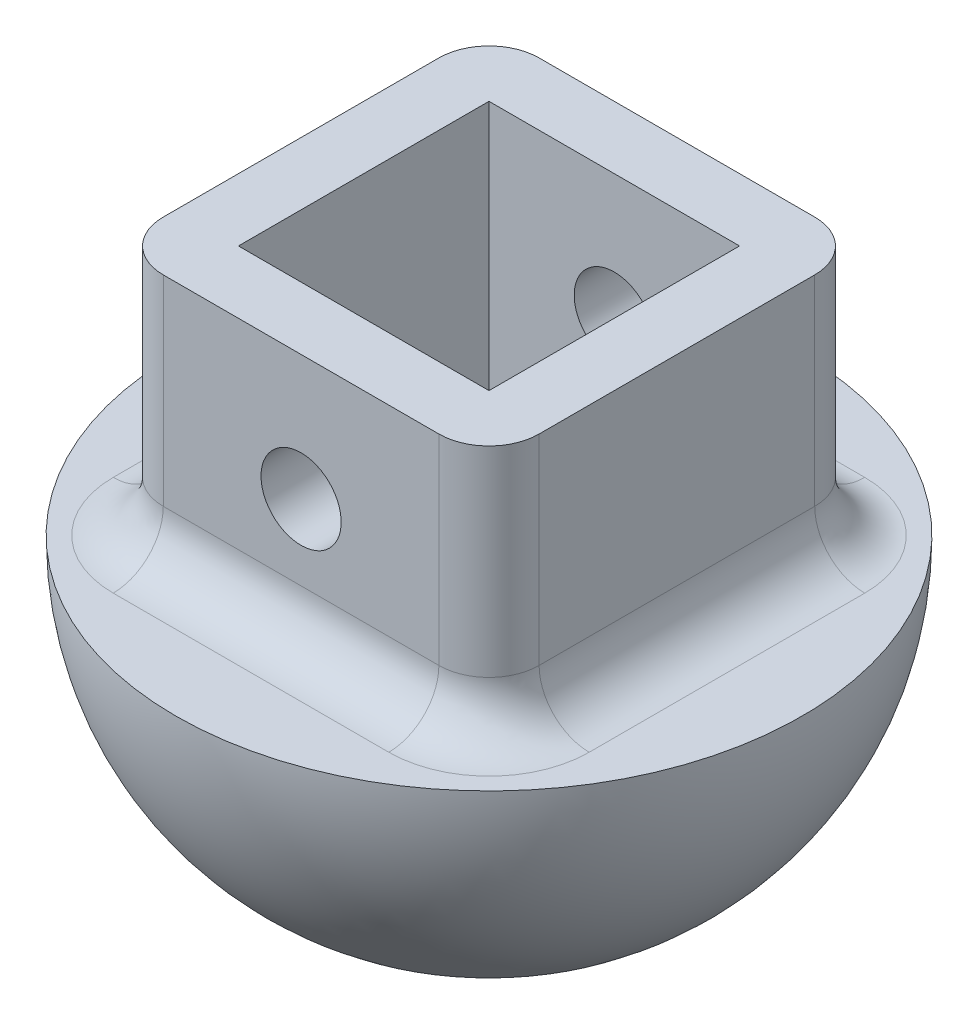
ISO-10303-21;
HEADER;
FILE_DESCRIPTION(('STEP AP214'),'2;1');
FILE_NAME('part.step','',(''),(''),'','','');
FILE_SCHEMA(('AUTOMOTIVE_DESIGN { 1 0 10303 214 1 1 1 1 }'));
ENDSEC;
DATA;
#1=APPLICATION_CONTEXT('core data for automotive mechanical design processes');
#2=APPLICATION_PROTOCOL_DEFINITION('international standard','automotive_design',2000,#1);
#3=PRODUCT_CONTEXT('',#1,'mechanical');
#4=PRODUCT('Part','Part','',(#3));
#5=PRODUCT_RELATED_PRODUCT_CATEGORY('part','',(#4));
#6=PRODUCT_DEFINITION_FORMATION('','',#4);
#7=PRODUCT_DEFINITION_CONTEXT('part definition',#1,'design');
#8=PRODUCT_DEFINITION('design','',#6,#7);
#9=PRODUCT_DEFINITION_SHAPE('','',#8);
#10=(LENGTH_UNIT() NAMED_UNIT(*) SI_UNIT(.MILLI.,.METRE.));
#11=(NAMED_UNIT(*) PLANE_ANGLE_UNIT() SI_UNIT($,.RADIAN.));
#12=(NAMED_UNIT(*) SI_UNIT($,.STERADIAN.) SOLID_ANGLE_UNIT());
#13=UNCERTAINTY_MEASURE_WITH_UNIT(LENGTH_MEASURE(1.E-05),#10,'distance_accuracy_value','');
#14=(GEOMETRIC_REPRESENTATION_CONTEXT(3) GLOBAL_UNCERTAINTY_ASSIGNED_CONTEXT((#13)) GLOBAL_UNIT_ASSIGNED_CONTEXT((#10,
#11,#12)) REPRESENTATION_CONTEXT('',''));
#15=CARTESIAN_POINT('',(0.,0.,0.));
#16=DIRECTION('',(0.,0.,1.));
#17=DIRECTION('',(1.,0.,0.));
#18=AXIS2_PLACEMENT_3D('',#15,#16,#17);
#19=CARTESIAN_POINT('',(0.,0.,0.));
#20=DIRECTION('',(0.,-1.,0.));
#21=DIRECTION('',(0.,0.,-1.));
#22=AXIS2_PLACEMENT_3D('',#19,#20,#21);
#23=PLANE('',#22);
#24=CARTESIAN_POINT('',(0.,0.,0.));
#25=DIRECTION('',(0.,-1.,0.));
#26=DIRECTION('',(0.,0.,-1.));
#27=AXIS2_PLACEMENT_3D('',#24,#25,#26);
#28=CIRCLE('',#27,12.5);
#29=CARTESIAN_POINT('',(0.,0.,-12.5));
#30=VERTEX_POINT('',#29);
#31=EDGE_CURVE('E208',#30,#30,#28,.T.);
#32=ORIENTED_EDGE('',*,*,#31,.F.);
#33=EDGE_LOOP('',(#32));
#34=FACE_BOUND('',#33,.T.);
#35=CARTESIAN_POINT('',(-5.5,0.,-5.50000000000001));
#36=DIRECTION('',(0.,-1.,0.));
#37=DIRECTION('',(0.,0.,-1.));
#38=AXIS2_PLACEMENT_3D('',#35,#36,#37);
#39=CIRCLE('',#38,4.);
#40=CARTESIAN_POINT('',(-5.5,0.,-9.50000000000001));
#41=VERTEX_POINT('',#40);
#42=CARTESIAN_POINT('',(-9.5,0.,-5.50000000000001));
#43=VERTEX_POINT('',#42);
#44=EDGE_CURVE('E240',#41,#43,#39,.F.);
#45=ORIENTED_EDGE('',*,*,#44,.F.);
#46=DIRECTION('',(-1.,0.,0.));
#47=VECTOR('',#46,1.);
#48=CARTESIAN_POINT('',(7.5,0.,-9.50000000000001));
#49=LINE('',#48,#47);
#50=CARTESIAN_POINT('',(5.5,0.,-9.50000000000001));
#51=VERTEX_POINT('',#50);
#52=EDGE_CURVE('E237',#41,#51,#49,.F.);
#53=ORIENTED_EDGE('',*,*,#52,.T.);
#54=CARTESIAN_POINT('',(5.5,0.,-5.50000000000001));
#55=DIRECTION('',(0.,-1.,0.));
#56=DIRECTION('',(0.,0.,-1.));
#57=AXIS2_PLACEMENT_3D('',#54,#55,#56);
#58=CIRCLE('',#57,4.);
#59=CARTESIAN_POINT('',(9.5,0.,-5.50000000000001));
#60=VERTEX_POINT('',#59);
#61=EDGE_CURVE('E234',#60,#51,#58,.F.);
#62=ORIENTED_EDGE('',*,*,#61,.F.);
#63=DIRECTION('',(0.,0.,-1.));
#64=VECTOR('',#63,1.);
#65=CARTESIAN_POINT('',(9.5,0.,7.5));
#66=LINE('',#65,#64);
#67=CARTESIAN_POINT('',(9.5,0.,5.49999999999999));
#68=VERTEX_POINT('',#67);
#69=EDGE_CURVE('E232',#60,#68,#66,.F.);
#70=ORIENTED_EDGE('',*,*,#69,.T.);
#71=CARTESIAN_POINT('',(5.5,0.,5.49999999999999));
#72=DIRECTION('',(0.,-1.,0.));
#73=DIRECTION('',(0.,0.,-1.));
#74=AXIS2_PLACEMENT_3D('',#71,#72,#73);
#75=CIRCLE('',#74,4.);
#76=CARTESIAN_POINT('',(5.5,0.,9.49999999999999));
#77=VERTEX_POINT('',#76);
#78=EDGE_CURVE('E229',#77,#68,#75,.F.);
#79=ORIENTED_EDGE('',*,*,#78,.F.);
#80=DIRECTION('',(1.,0.,0.));
#81=VECTOR('',#80,1.);
#82=CARTESIAN_POINT('',(-7.5,0.,9.49999999999999));
#83=LINE('',#82,#81);
#84=CARTESIAN_POINT('',(-5.5,0.,9.49999999999999));
#85=VERTEX_POINT('',#84);
#86=EDGE_CURVE('E225',#77,#85,#83,.F.);
#87=ORIENTED_EDGE('',*,*,#86,.T.);
#88=CARTESIAN_POINT('',(-5.5,0.,5.49999999999999));
#89=DIRECTION('',(0.,-1.,0.));
#90=DIRECTION('',(0.,0.,-1.));
#91=AXIS2_PLACEMENT_3D('',#88,#89,#90);
#92=CIRCLE('',#91,4.);
#93=CARTESIAN_POINT('',(-9.5,0.,5.49999999999999));
#94=VERTEX_POINT('',#93);
#95=EDGE_CURVE('E222',#94,#85,#92,.F.);
#96=ORIENTED_EDGE('',*,*,#95,.F.);
#97=DIRECTION('',(0.,0.,1.));
#98=VECTOR('',#97,1.);
#99=CARTESIAN_POINT('',(-9.5,0.,-7.5));
#100=LINE('',#99,#98);
#101=EDGE_CURVE('E227',#94,#43,#100,.F.);
#102=ORIENTED_EDGE('',*,*,#101,.T.);
#103=EDGE_LOOP('',(#45,#53,#62,#70,#79,#87,#96,#102));
#104=FACE_BOUND('',#103,.T.);
#105=ADVANCED_FACE('F39',(#34,#104),#23,.F.);
#106=CARTESIAN_POINT('',(0.,0.,0.));
#107=DIRECTION('',(-1.,0.,0.));
#108=DIRECTION('',(0.,0.,1.));
#109=AXIS2_PLACEMENT_3D('',#106,#107,#108);
#110=SPHERICAL_SURFACE('',#109,12.5);
#111=CARTESIAN_POINT('',(0.,0.,0.));
#112=DIRECTION('',(0.,-1.,0.));
#113=DIRECTION('',(0.,0.,-1.));
#114=AXIS2_PLACEMENT_3D('',#111,#112,#113);
#115=SPHERICAL_SURFACE('',#114,12.5);
#116=ORIENTED_EDGE('',*,*,#31,.T.);
#117=EDGE_LOOP('',(#116));
#118=FACE_BOUND('',#117,.T.);
#119=ADVANCED_FACE('F369',(#118),#115,.T.);
#120=CARTESIAN_POINT('',(0.,10.,0.));
#121=DIRECTION('',(0.,1.,0.));
#122=DIRECTION('',(0.,0.,1.));
#123=AXIS2_PLACEMENT_3D('',#120,#121,#122);
#124=PLANE('',#123);
#125=DIRECTION('',(0.,0.,1.));
#126=VECTOR('',#125,1.);
#127=CARTESIAN_POINT('',(-7.5,10.,-7.5));
#128=LINE('',#127,#126);
#129=CARTESIAN_POINT('',(-7.5,10.,-5.5));
#130=VERTEX_POINT('',#129);
#131=CARTESIAN_POINT('',(-7.5,10.,5.5));
#132=VERTEX_POINT('',#131);
#133=EDGE_CURVE('E202',#130,#132,#128,.T.);
#134=ORIENTED_EDGE('',*,*,#133,.T.);
#135=CARTESIAN_POINT('',(-5.5,10.,5.5));
#136=DIRECTION('',(0.,1.,0.));
#137=DIRECTION('',(0.,0.,1.));
#138=AXIS2_PLACEMENT_3D('',#135,#136,#137);
#139=CIRCLE('',#138,2.);
#140=CARTESIAN_POINT('',(-5.5,10.,7.5));
#141=VERTEX_POINT('',#140);
#142=EDGE_CURVE('E11',#132,#141,#139,.T.);
#143=ORIENTED_EDGE('',*,*,#142,.T.);
#144=DIRECTION('',(1.,0.,0.));
#145=VECTOR('',#144,1.);
#146=CARTESIAN_POINT('',(-7.5,10.,7.5));
#147=LINE('',#146,#145);
#148=CARTESIAN_POINT('',(5.5,10.,7.5));
#149=VERTEX_POINT('',#148);
#150=EDGE_CURVE('E205',#141,#149,#147,.T.);
#151=ORIENTED_EDGE('',*,*,#150,.T.);
#152=CARTESIAN_POINT('',(5.5,10.,5.5));
#153=DIRECTION('',(0.,1.,0.));
#154=DIRECTION('',(0.,0.,1.));
#155=AXIS2_PLACEMENT_3D('',#152,#153,#154);
#156=CIRCLE('',#155,2.);
#157=CARTESIAN_POINT('',(7.5,10.,5.5));
#158=VERTEX_POINT('',#157);
#159=EDGE_CURVE('E259',#149,#158,#156,.T.);
#160=ORIENTED_EDGE('',*,*,#159,.T.);
#161=DIRECTION('',(0.,0.,-1.));
#162=VECTOR('',#161,1.);
#163=CARTESIAN_POINT('',(7.5,10.,-7.5));
#164=LINE('',#163,#162);
#165=CARTESIAN_POINT('',(7.5,10.,-5.5));
#166=VERTEX_POINT('',#165);
#167=EDGE_CURVE('E171',#158,#166,#164,.T.);
#168=ORIENTED_EDGE('',*,*,#167,.T.);
#169=CARTESIAN_POINT('',(5.5,10.,-5.5));
#170=DIRECTION('',(0.,1.,0.));
#171=DIRECTION('',(0.,0.,1.));
#172=AXIS2_PLACEMENT_3D('',#169,#170,#171);
#173=CIRCLE('',#172,2.);
#174=CARTESIAN_POINT('',(5.5,10.,-7.5));
#175=VERTEX_POINT('',#174);
#176=EDGE_CURVE('E261',#166,#175,#173,.T.);
#177=ORIENTED_EDGE('',*,*,#176,.T.);
#178=DIRECTION('',(-1.,0.,0.));
#179=VECTOR('',#178,1.);
#180=CARTESIAN_POINT('',(-7.5,10.,-7.5));
#181=LINE('',#180,#179);
#182=CARTESIAN_POINT('',(-5.5,10.,-7.5));
#183=VERTEX_POINT('',#182);
#184=EDGE_CURVE('E199',#175,#183,#181,.T.);
#185=ORIENTED_EDGE('',*,*,#184,.T.);
#186=CARTESIAN_POINT('',(-5.5,10.,-5.5));
#187=DIRECTION('',(0.,1.,0.));
#188=DIRECTION('',(0.,0.,1.));
#189=AXIS2_PLACEMENT_3D('',#186,#187,#188);
#190=CIRCLE('',#189,2.);
#191=EDGE_CURVE('E48',#183,#130,#190,.T.);
#192=ORIENTED_EDGE('',*,*,#191,.T.);
#193=EDGE_LOOP('',(#134,#143,#151,#160,#168,#177,#185,#192));
#194=FACE_BOUND('',#193,.T.);
#195=DIRECTION('',(-1.,0.,0.));
#196=VECTOR('',#195,1.);
#197=CARTESIAN_POINT('',(-5.,10.,-5.));
#198=LINE('',#197,#196);
#199=CARTESIAN_POINT('',(5.,10.,-5.));
#200=VERTEX_POINT('',#199);
#201=CARTESIAN_POINT('',(-5.,10.,-5.));
#202=VERTEX_POINT('',#201);
#203=EDGE_CURVE('E163',#200,#202,#198,.T.);
#204=ORIENTED_EDGE('',*,*,#203,.F.);
#205=DIRECTION('',(0.,0.,-1.));
#206=VECTOR('',#205,1.);
#207=CARTESIAN_POINT('',(5.,10.,-5.));
#208=LINE('',#207,#206);
#209=CARTESIAN_POINT('',(5.,10.,5.));
#210=VERTEX_POINT('',#209);
#211=EDGE_CURVE('E153',#210,#200,#208,.T.);
#212=ORIENTED_EDGE('',*,*,#211,.F.);
#213=DIRECTION('',(1.,0.,0.));
#214=VECTOR('',#213,1.);
#215=CARTESIAN_POINT('',(-5.,10.,5.));
#216=LINE('',#215,#214);
#217=CARTESIAN_POINT('',(-5.,10.,5.));
#218=VERTEX_POINT('',#217);
#219=EDGE_CURVE('E179',#218,#210,#216,.T.);
#220=ORIENTED_EDGE('',*,*,#219,.F.);
#221=DIRECTION('',(0.,0.,1.));
#222=VECTOR('',#221,1.);
#223=CARTESIAN_POINT('',(-5.,10.,-5.));
#224=LINE('',#223,#222);
#225=EDGE_CURVE('E177',#202,#218,#224,.T.);
#226=ORIENTED_EDGE('',*,*,#225,.F.);
#227=EDGE_LOOP('',(#204,#212,#220,#226));
#228=FACE_BOUND('',#227,.T.);
#229=ADVANCED_FACE('F175',(#194,#228),#124,.T.);
#230=CARTESIAN_POINT('',(7.5,10.,-7.5));
#231=DIRECTION('',(-1.,0.,0.));
#232=DIRECTION('',(0.,0.,1.));
#233=AXIS2_PLACEMENT_3D('',#230,#231,#232);
#234=PLANE('',#233);
#235=DIRECTION('',(0.,0.,-1.));
#236=VECTOR('',#235,1.);
#237=CARTESIAN_POINT('',(7.5,2.00000000000005,-7.49999999999999));
#238=LINE('',#237,#236);
#239=CARTESIAN_POINT('',(7.5,1.99999999999996,5.5));
#240=VERTEX_POINT('',#239);
#241=CARTESIAN_POINT('',(7.5,2.00000000000004,-5.5));
#242=VERTEX_POINT('',#241);
#243=EDGE_CURVE('E245',#240,#242,#238,.T.);
#244=ORIENTED_EDGE('',*,*,#243,.T.);
#245=DIRECTION('',(0.,-1.,0.));
#246=VECTOR('',#245,1.);
#247=CARTESIAN_POINT('',(7.5,10.,-5.5));
#248=LINE('',#247,#246);
#249=EDGE_CURVE('E247',#242,#166,#248,.F.);
#250=ORIENTED_EDGE('',*,*,#249,.T.);
#251=ORIENTED_EDGE('',*,*,#167,.F.);
#252=DIRECTION('',(0.,-1.,0.));
#253=VECTOR('',#252,1.);
#254=CARTESIAN_POINT('',(7.5,10.,5.5));
#255=LINE('',#254,#253);
#256=EDGE_CURVE('E243',#158,#240,#255,.T.);
#257=ORIENTED_EDGE('',*,*,#256,.T.);
#258=EDGE_LOOP('',(#244,#250,#251,#257));
#259=FACE_BOUND('',#258,.T.);
#260=ADVANCED_FACE('F323',(#259),#234,.F.);
#261=CARTESIAN_POINT('',(-7.5,10.,-7.5));
#262=DIRECTION('',(0.,0.,1.));
#263=DIRECTION('',(1.,0.,0.));
#264=AXIS2_PLACEMENT_3D('',#261,#262,#263);
#265=PLANE('',#264);
#266=CARTESIAN_POINT('',(0.,5.,-7.5));
#267=DIRECTION('',(0.,0.,1.));
#268=DIRECTION('',(1.,0.,0.));
#269=AXIS2_PLACEMENT_3D('',#266,#267,#268);
#270=CIRCLE('',#269,1.6);
#271=CARTESIAN_POINT('',(1.6,5.,-7.5));
#272=VERTEX_POINT('',#271);
#273=EDGE_CURVE('E186',#272,#272,#270,.F.);
#274=ORIENTED_EDGE('',*,*,#273,.F.);
#275=EDGE_LOOP('',(#274));
#276=FACE_BOUND('',#275,.T.);
#277=DIRECTION('',(-1.,0.,0.));
#278=VECTOR('',#277,1.);
#279=CARTESIAN_POINT('',(-7.5,2.00000000000007,-7.5));
#280=LINE('',#279,#278);
#281=CARTESIAN_POINT('',(5.5,2.00000000000007,-7.5));
#282=VERTEX_POINT('',#281);
#283=CARTESIAN_POINT('',(-5.5,2.00000000000007,-7.5));
#284=VERTEX_POINT('',#283);
#285=EDGE_CURVE('E217',#282,#284,#280,.T.);
#286=ORIENTED_EDGE('',*,*,#285,.T.);
#287=DIRECTION('',(0.,-1.,0.));
#288=VECTOR('',#287,1.);
#289=CARTESIAN_POINT('',(-5.5,10.,-7.5));
#290=LINE('',#289,#288);
#291=EDGE_CURVE('E220',#284,#183,#290,.F.);
#292=ORIENTED_EDGE('',*,*,#291,.T.);
#293=ORIENTED_EDGE('',*,*,#184,.F.);
#294=DIRECTION('',(0.,-1.,0.));
#295=VECTOR('',#294,1.);
#296=CARTESIAN_POINT('',(5.5,10.,-7.5));
#297=LINE('',#296,#295);
#298=EDGE_CURVE('E211',#175,#282,#297,.T.);
#299=ORIENTED_EDGE('',*,*,#298,.T.);
#300=EDGE_LOOP('',(#286,#292,#293,#299));
#301=FACE_BOUND('',#300,.T.);
#302=ADVANCED_FACE('F354',(#276,#301),#265,.F.);
#303=CARTESIAN_POINT('',(-7.5,10.,-7.5));
#304=DIRECTION('',(1.,0.,0.));
#305=DIRECTION('',(0.,0.,-1.));
#306=AXIS2_PLACEMENT_3D('',#303,#304,#305);
#307=PLANE('',#306);
#308=DIRECTION('',(0.,0.,1.));
#309=VECTOR('',#308,1.);
#310=CARTESIAN_POINT('',(-7.5,1.99999999999995,7.50000000000001));
#311=LINE('',#310,#309);
#312=CARTESIAN_POINT('',(-7.5,2.00000000000004,-5.5));
#313=VERTEX_POINT('',#312);
#314=CARTESIAN_POINT('',(-7.5,1.99999999999996,5.5));
#315=VERTEX_POINT('',#314);
#316=EDGE_CURVE('E251',#313,#315,#311,.T.);
#317=ORIENTED_EDGE('',*,*,#316,.T.);
#318=DIRECTION('',(0.,-1.,0.));
#319=VECTOR('',#318,1.);
#320=CARTESIAN_POINT('',(-7.5,10.,5.5));
#321=LINE('',#320,#319);
#322=EDGE_CURVE('E253',#315,#132,#321,.F.);
#323=ORIENTED_EDGE('',*,*,#322,.T.);
#324=ORIENTED_EDGE('',*,*,#133,.F.);
#325=DIRECTION('',(0.,-1.,0.));
#326=VECTOR('',#325,1.);
#327=CARTESIAN_POINT('',(-7.5,10.,-5.5));
#328=LINE('',#327,#326);
#329=EDGE_CURVE('E249',#130,#313,#328,.T.);
#330=ORIENTED_EDGE('',*,*,#329,.T.);
#331=EDGE_LOOP('',(#317,#323,#324,#330));
#332=FACE_BOUND('',#331,.T.);
#333=ADVANCED_FACE('F357',(#332),#307,.F.);
#334=CARTESIAN_POINT('',(-7.5,10.,7.5));
#335=DIRECTION('',(0.,0.,-1.));
#336=DIRECTION('',(-1.,0.,0.));
#337=AXIS2_PLACEMENT_3D('',#334,#335,#336);
#338=PLANE('',#337);
#339=CARTESIAN_POINT('',(0.,5.,7.5));
#340=DIRECTION('',(0.,0.,-1.));
#341=DIRECTION('',(-1.,0.,0.));
#342=AXIS2_PLACEMENT_3D('',#339,#340,#341);
#343=CIRCLE('',#342,1.6);
#344=CARTESIAN_POINT('',(-1.6,5.,7.5));
#345=VERTEX_POINT('',#344);
#346=EDGE_CURVE('E593',#345,#345,#343,.F.);
#347=ORIENTED_EDGE('',*,*,#346,.F.);
#348=EDGE_LOOP('',(#347));
#349=FACE_BOUND('',#348,.T.);
#350=ORIENTED_EDGE('',*,*,#150,.F.);
#351=DIRECTION('',(0.,-1.,0.));
#352=VECTOR('',#351,1.);
#353=CARTESIAN_POINT('',(-5.5,10.,7.5));
#354=LINE('',#353,#352);
#355=CARTESIAN_POINT('',(-5.5,1.99999999999993,7.5));
#356=VERTEX_POINT('',#355);
#357=EDGE_CURVE('E56',#141,#356,#354,.T.);
#358=ORIENTED_EDGE('',*,*,#357,.T.);
#359=DIRECTION('',(1.,0.,0.));
#360=VECTOR('',#359,1.);
#361=CARTESIAN_POINT('',(7.5,1.99999999999993,7.5));
#362=LINE('',#361,#360);
#363=CARTESIAN_POINT('',(5.5,1.99999999999993,7.5));
#364=VERTEX_POINT('',#363);
#365=EDGE_CURVE('E60',#356,#364,#362,.T.);
#366=ORIENTED_EDGE('',*,*,#365,.T.);
#367=DIRECTION('',(0.,-1.,0.));
#368=VECTOR('',#367,1.);
#369=CARTESIAN_POINT('',(5.5,10.,7.5));
#370=LINE('',#369,#368);
#371=EDGE_CURVE('E255',#364,#149,#370,.F.);
#372=ORIENTED_EDGE('',*,*,#371,.T.);
#373=EDGE_LOOP('',(#350,#358,#366,#372));
#374=FACE_BOUND('',#373,.T.);
#375=ADVANCED_FACE('F329',(#349,#374),#338,.F.);
#376=CARTESIAN_POINT('',(5.,10.,-5.));
#377=DIRECTION('',(-1.,0.,0.));
#378=DIRECTION('',(0.,0.,1.));
#379=AXIS2_PLACEMENT_3D('',#376,#377,#378);
#380=PLANE('',#379);
#381=DIRECTION('',(0.,0.,-1.));
#382=VECTOR('',#381,1.);
#383=CARTESIAN_POINT('',(5.,0.,-5.));
#384=LINE('',#383,#382);
#385=CARTESIAN_POINT('',(5.,0.,5.));
#386=VERTEX_POINT('',#385);
#387=CARTESIAN_POINT('',(5.,0.,-5.));
#388=VERTEX_POINT('',#387);
#389=EDGE_CURVE('E184',#386,#388,#384,.T.);
#390=ORIENTED_EDGE('',*,*,#389,.F.);
#391=DIRECTION('',(0.,-1.,0.));
#392=VECTOR('',#391,1.);
#393=CARTESIAN_POINT('',(5.,10.,5.));
#394=LINE('',#393,#392);
#395=EDGE_CURVE('E159',#210,#386,#394,.T.);
#396=ORIENTED_EDGE('',*,*,#395,.F.);
#397=ORIENTED_EDGE('',*,*,#211,.T.);
#398=DIRECTION('',(0.,-1.,0.));
#399=VECTOR('',#398,1.);
#400=CARTESIAN_POINT('',(5.,10.,-5.));
#401=LINE('',#400,#399);
#402=EDGE_CURVE('E157',#200,#388,#401,.T.);
#403=ORIENTED_EDGE('',*,*,#402,.T.);
#404=EDGE_LOOP('',(#390,#396,#397,#403));
#405=FACE_BOUND('',#404,.T.);
#406=ADVANCED_FACE('F156',(#405),#380,.T.);
#407=CARTESIAN_POINT('',(-5.,10.,-5.));
#408=DIRECTION('',(0.,0.,1.));
#409=DIRECTION('',(1.,0.,0.));
#410=AXIS2_PLACEMENT_3D('',#407,#408,#409);
#411=PLANE('',#410);
#412=CARTESIAN_POINT('',(0.,5.,-5.));
#413=DIRECTION('',(0.,0.,1.));
#414=DIRECTION('',(1.,0.,0.));
#415=AXIS2_PLACEMENT_3D('',#412,#413,#414);
#416=CIRCLE('',#415,1.6);
#417=CARTESIAN_POINT('',(1.6,5.,-5.));
#418=VERTEX_POINT('',#417);
#419=EDGE_CURVE('E215',#418,#418,#416,.F.);
#420=ORIENTED_EDGE('',*,*,#419,.T.);
#421=EDGE_LOOP('',(#420));
#422=FACE_BOUND('',#421,.T.);
#423=DIRECTION('',(-1.,0.,0.));
#424=VECTOR('',#423,1.);
#425=CARTESIAN_POINT('',(-5.,0.,-5.));
#426=LINE('',#425,#424);
#427=CARTESIAN_POINT('',(-5.,0.,-5.));
#428=VERTEX_POINT('',#427);
#429=EDGE_CURVE('E170',#388,#428,#426,.T.);
#430=ORIENTED_EDGE('',*,*,#429,.F.);
#431=ORIENTED_EDGE('',*,*,#402,.F.);
#432=ORIENTED_EDGE('',*,*,#203,.T.);
#433=DIRECTION('',(0.,-1.,0.));
#434=VECTOR('',#433,1.);
#435=CARTESIAN_POINT('',(-5.,10.,-5.));
#436=LINE('',#435,#434);
#437=EDGE_CURVE('E172',#202,#428,#436,.T.);
#438=ORIENTED_EDGE('',*,*,#437,.T.);
#439=EDGE_LOOP('',(#430,#431,#432,#438));
#440=FACE_BOUND('',#439,.T.);
#441=ADVANCED_FACE('F167',(#422,#440),#411,.T.);
#442=CARTESIAN_POINT('',(-5.,10.,-5.));
#443=DIRECTION('',(1.,0.,0.));
#444=DIRECTION('',(0.,0.,-1.));
#445=AXIS2_PLACEMENT_3D('',#442,#443,#444);
#446=PLANE('',#445);
#447=DIRECTION('',(0.,0.,1.));
#448=VECTOR('',#447,1.);
#449=CARTESIAN_POINT('',(-5.,0.,-5.));
#450=LINE('',#449,#448);
#451=CARTESIAN_POINT('',(-5.,0.,5.));
#452=VERTEX_POINT('',#451);
#453=EDGE_CURVE('E188',#428,#452,#450,.T.);
#454=ORIENTED_EDGE('',*,*,#453,.F.);
#455=ORIENTED_EDGE('',*,*,#437,.F.);
#456=ORIENTED_EDGE('',*,*,#225,.T.);
#457=DIRECTION('',(0.,-1.,0.));
#458=VECTOR('',#457,1.);
#459=CARTESIAN_POINT('',(-5.,10.,5.));
#460=LINE('',#459,#458);
#461=EDGE_CURVE('E194',#218,#452,#460,.T.);
#462=ORIENTED_EDGE('',*,*,#461,.T.);
#463=EDGE_LOOP('',(#454,#455,#456,#462));
#464=FACE_BOUND('',#463,.T.);
#465=ADVANCED_FACE('F391',(#464),#446,.T.);
#466=CARTESIAN_POINT('',(-5.,10.,5.));
#467=DIRECTION('',(0.,0.,-1.));
#468=DIRECTION('',(-1.,0.,0.));
#469=AXIS2_PLACEMENT_3D('',#466,#467,#468);
#470=PLANE('',#469);
#471=CARTESIAN_POINT('',(0.,5.,5.));
#472=DIRECTION('',(0.,0.,-1.));
#473=DIRECTION('',(-1.,0.,0.));
#474=AXIS2_PLACEMENT_3D('',#471,#472,#473);
#475=CIRCLE('',#474,1.6);
#476=CARTESIAN_POINT('',(-1.6,5.,5.));
#477=VERTEX_POINT('',#476);
#478=EDGE_CURVE('E212',#477,#477,#475,.F.);
#479=ORIENTED_EDGE('',*,*,#478,.T.);
#480=EDGE_LOOP('',(#479));
#481=FACE_BOUND('',#480,.T.);
#482=DIRECTION('',(1.,0.,0.));
#483=VECTOR('',#482,1.);
#484=CARTESIAN_POINT('',(-5.,0.,5.));
#485=LINE('',#484,#483);
#486=EDGE_CURVE('E164',#452,#386,#485,.T.);
#487=ORIENTED_EDGE('',*,*,#486,.F.);
#488=ORIENTED_EDGE('',*,*,#461,.F.);
#489=ORIENTED_EDGE('',*,*,#219,.T.);
#490=ORIENTED_EDGE('',*,*,#395,.T.);
#491=EDGE_LOOP('',(#487,#488,#489,#490));
#492=FACE_BOUND('',#491,.T.);
#493=ADVANCED_FACE('F382',(#481,#492),#470,.T.);
#494=ORIENTED_EDGE('',*,*,#486,.T.);
#495=ORIENTED_EDGE('',*,*,#389,.T.);
#496=ORIENTED_EDGE('',*,*,#429,.T.);
#497=ORIENTED_EDGE('',*,*,#453,.T.);
#498=EDGE_LOOP('',(#494,#495,#496,#497));
#499=FACE_BOUND('',#498,.T.);
#500=ADVANCED_FACE('F372',(#499),#23,.F.);
#501=CARTESIAN_POINT('',(0.,5.,-15.));
#502=DIRECTION('',(0.,0.,1.));
#503=DIRECTION('',(1.,0.,0.));
#504=AXIS2_PLACEMENT_3D('',#501,#502,#503);
#505=CYLINDRICAL_SURFACE('',#504,1.6);
#506=ORIENTED_EDGE('',*,*,#478,.F.);
#507=EDGE_LOOP('',(#506));
#508=FACE_BOUND('',#507,.T.);
#509=ORIENTED_EDGE('',*,*,#346,.T.);
#510=EDGE_LOOP('',(#509));
#511=FACE_BOUND('',#510,.T.);
#512=ADVANCED_FACE('F381',(#508,#511),#505,.F.);
#513=ORIENTED_EDGE('',*,*,#419,.F.);
#514=EDGE_LOOP('',(#513));
#515=FACE_BOUND('',#514,.T.);
#516=ORIENTED_EDGE('',*,*,#273,.T.);
#517=EDGE_LOOP('',(#516));
#518=FACE_BOUND('',#517,.T.);
#519=ADVANCED_FACE('F388',(#515,#518),#505,.F.);
#520=CARTESIAN_POINT('',(5.5,10.,5.5));
#521=DIRECTION('',(0.,-1.,0.));
#522=DIRECTION('',(0.,0.,-1.));
#523=AXIS2_PLACEMENT_3D('',#520,#521,#522);
#524=CYLINDRICAL_SURFACE('',#523,2.);
#525=ORIENTED_EDGE('',*,*,#159,.F.);
#526=ORIENTED_EDGE('',*,*,#371,.F.);
#527=CARTESIAN_POINT('',(5.5,1.99999999999996,5.5));
#528=DIRECTION('',(0.,-1.,0.));
#529=DIRECTION('',(0.,0.,-1.));
#530=AXIS2_PLACEMENT_3D('',#527,#528,#529);
#531=CIRCLE('',#530,2.);
#532=EDGE_CURVE('E291',#240,#364,#531,.T.);
#533=ORIENTED_EDGE('',*,*,#532,.F.);
#534=ORIENTED_EDGE('',*,*,#256,.F.);
#535=EDGE_LOOP('',(#525,#526,#533,#534));
#536=FACE_BOUND('',#535,.T.);
#537=ADVANCED_FACE('F41',(#536),#524,.T.);
#538=CARTESIAN_POINT('',(-5.5,10.,5.5));
#539=DIRECTION('',(0.,-1.,0.));
#540=DIRECTION('',(0.,0.,-1.));
#541=AXIS2_PLACEMENT_3D('',#538,#539,#540);
#542=CYLINDRICAL_SURFACE('',#541,2.);
#543=ORIENTED_EDGE('',*,*,#142,.F.);
#544=ORIENTED_EDGE('',*,*,#322,.F.);
#545=CARTESIAN_POINT('',(-5.5,1.99999999999995,5.5));
#546=DIRECTION('',(0.,-1.,0.));
#547=DIRECTION('',(0.,0.,-1.));
#548=AXIS2_PLACEMENT_3D('',#545,#546,#547);
#549=CIRCLE('',#548,2.);
#550=EDGE_CURVE('E289',#356,#315,#549,.T.);
#551=ORIENTED_EDGE('',*,*,#550,.F.);
#552=ORIENTED_EDGE('',*,*,#357,.F.);
#553=EDGE_LOOP('',(#543,#544,#551,#552));
#554=FACE_BOUND('',#553,.T.);
#555=ADVANCED_FACE('F332',(#554),#542,.T.);
#556=CARTESIAN_POINT('',(-7.5,1.99999999999993,9.5));
#557=DIRECTION('',(-1.,0.,0.));
#558=DIRECTION('',(0.,0.,1.));
#559=AXIS2_PLACEMENT_3D('',#556,#557,#558);
#560=CYLINDRICAL_SURFACE('',#559,2.);
#561=CARTESIAN_POINT('',(-5.5,1.99999999999993,9.5));
#562=DIRECTION('',(1.,0.,0.));
#563=DIRECTION('',(0.,0.,-1.));
#564=AXIS2_PLACEMENT_3D('',#561,#562,#563);
#565=CIRCLE('',#564,2.);
#566=EDGE_CURVE('E286',#85,#356,#565,.T.);
#567=ORIENTED_EDGE('',*,*,#566,.F.);
#568=ORIENTED_EDGE('',*,*,#86,.F.);
#569=CARTESIAN_POINT('',(5.5,1.99999999999993,9.5));
#570=DIRECTION('',(-1.,0.,0.));
#571=DIRECTION('',(0.,0.,1.));
#572=AXIS2_PLACEMENT_3D('',#569,#570,#571);
#573=CIRCLE('',#572,2.);
#574=EDGE_CURVE('E43',#364,#77,#573,.T.);
#575=ORIENTED_EDGE('',*,*,#574,.F.);
#576=ORIENTED_EDGE('',*,*,#365,.F.);
#577=EDGE_LOOP('',(#567,#568,#575,#576));
#578=FACE_BOUND('',#577,.T.);
#579=ADVANCED_FACE('F302',(#578),#560,.F.);
#580=CARTESIAN_POINT('',(5.5,1.99999999999996,5.5));
#581=DIRECTION('',(0.,-1.,0.));
#582=DIRECTION('',(0.,0.,-1.));
#583=AXIS2_PLACEMENT_3D('',#580,#581,#582);
#584=TOROIDAL_SURFACE('',#583,4.,2.);
#585=ORIENTED_EDGE('',*,*,#574,.T.);
#586=ORIENTED_EDGE('',*,*,#78,.T.);
#587=CARTESIAN_POINT('',(9.5,1.99999999999996,5.5));
#588=DIRECTION('',(0.,0.,-1.));
#589=DIRECTION('',(0.,1.,0.));
#590=AXIS2_PLACEMENT_3D('',#587,#588,#589);
#591=CIRCLE('',#590,2.);
#592=EDGE_CURVE('E283',#240,#68,#591,.F.);
#593=ORIENTED_EDGE('',*,*,#592,.F.);
#594=ORIENTED_EDGE('',*,*,#532,.T.);
#595=EDGE_LOOP('',(#585,#586,#593,#594));
#596=FACE_BOUND('',#595,.T.);
#597=ADVANCED_FACE('F298',(#596),#584,.F.);
#598=CARTESIAN_POINT('',(-5.5,1.99999999999996,5.5));
#599=DIRECTION('',(0.,-1.,0.));
#600=DIRECTION('',(0.,0.,-1.));
#601=AXIS2_PLACEMENT_3D('',#598,#599,#600);
#602=TOROIDAL_SURFACE('',#601,4.,2.);
#603=ORIENTED_EDGE('',*,*,#566,.T.);
#604=ORIENTED_EDGE('',*,*,#550,.T.);
#605=CARTESIAN_POINT('',(-9.5,1.99999999999996,5.5));
#606=DIRECTION('',(0.,0.,-1.));
#607=DIRECTION('',(0.,1.,0.));
#608=AXIS2_PLACEMENT_3D('',#605,#606,#607);
#609=CIRCLE('',#608,2.);
#610=EDGE_CURVE('E280',#94,#315,#609,.F.);
#611=ORIENTED_EDGE('',*,*,#610,.F.);
#612=ORIENTED_EDGE('',*,*,#95,.T.);
#613=EDGE_LOOP('',(#603,#604,#611,#612));
#614=FACE_BOUND('',#613,.T.);
#615=ADVANCED_FACE('F335',(#614),#602,.F.);
#616=CARTESIAN_POINT('',(9.5,2.00000000000005,-7.50000000000006));
#617=DIRECTION('',(0.,0.,1.));
#618=DIRECTION('',(0.,-1.,0.));
#619=AXIS2_PLACEMENT_3D('',#616,#617,#618);
#620=CYLINDRICAL_SURFACE('',#619,2.);
#621=ORIENTED_EDGE('',*,*,#592,.T.);
#622=ORIENTED_EDGE('',*,*,#69,.F.);
#623=CARTESIAN_POINT('',(9.5,2.00000000000004,-5.5));
#624=DIRECTION('',(0.,0.,1.));
#625=DIRECTION('',(0.,-1.,0.));
#626=AXIS2_PLACEMENT_3D('',#623,#624,#625);
#627=CIRCLE('',#626,2.);
#628=EDGE_CURVE('E277',#242,#60,#627,.T.);
#629=ORIENTED_EDGE('',*,*,#628,.F.);
#630=ORIENTED_EDGE('',*,*,#243,.F.);
#631=EDGE_LOOP('',(#621,#622,#629,#630));
#632=FACE_BOUND('',#631,.T.);
#633=ADVANCED_FACE('F309',(#632),#620,.F.);
#634=CARTESIAN_POINT('',(5.5,10.,-5.5));
#635=DIRECTION('',(0.,-1.,0.));
#636=DIRECTION('',(0.,0.,-1.));
#637=AXIS2_PLACEMENT_3D('',#634,#635,#636);
#638=CYLINDRICAL_SURFACE('',#637,2.);
#639=ORIENTED_EDGE('',*,*,#176,.F.);
#640=ORIENTED_EDGE('',*,*,#249,.F.);
#641=CARTESIAN_POINT('',(5.5,2.00000000000005,-5.5));
#642=DIRECTION('',(0.,-1.,0.));
#643=DIRECTION('',(0.,0.,-1.));
#644=AXIS2_PLACEMENT_3D('',#641,#642,#643);
#645=CIRCLE('',#644,2.);
#646=EDGE_CURVE('E274',#282,#242,#645,.T.);
#647=ORIENTED_EDGE('',*,*,#646,.F.);
#648=ORIENTED_EDGE('',*,*,#298,.F.);
#649=EDGE_LOOP('',(#639,#640,#647,#648));
#650=FACE_BOUND('',#649,.T.);
#651=ADVANCED_FACE('F320',(#650),#638,.T.);
#652=CARTESIAN_POINT('',(-5.5,10.,-5.5));
#653=DIRECTION('',(0.,-1.,0.));
#654=DIRECTION('',(0.,0.,-1.));
#655=AXIS2_PLACEMENT_3D('',#652,#653,#654);
#656=CYLINDRICAL_SURFACE('',#655,2.);
#657=ORIENTED_EDGE('',*,*,#191,.F.);
#658=ORIENTED_EDGE('',*,*,#291,.F.);
#659=CARTESIAN_POINT('',(-5.5,2.00000000000004,-5.5));
#660=DIRECTION('',(0.,-1.,0.));
#661=DIRECTION('',(0.,0.,-1.));
#662=AXIS2_PLACEMENT_3D('',#659,#660,#661);
#663=CIRCLE('',#662,2.);
#664=EDGE_CURVE('E271',#313,#284,#663,.T.);
#665=ORIENTED_EDGE('',*,*,#664,.F.);
#666=ORIENTED_EDGE('',*,*,#329,.F.);
#667=EDGE_LOOP('',(#657,#658,#665,#666));
#668=FACE_BOUND('',#667,.T.);
#669=ADVANCED_FACE('F352',(#668),#656,.T.);
#670=CARTESIAN_POINT('',(-9.5,2.00000000000005,-7.50000000000006));
#671=DIRECTION('',(0.,0.,-1.));
#672=DIRECTION('',(0.,1.,0.));
#673=AXIS2_PLACEMENT_3D('',#670,#671,#672);
#674=CYLINDRICAL_SURFACE('',#673,2.);
#675=ORIENTED_EDGE('',*,*,#610,.T.);
#676=ORIENTED_EDGE('',*,*,#316,.F.);
#677=CARTESIAN_POINT('',(-9.5,2.00000000000004,-5.5));
#678=DIRECTION('',(0.,0.,1.));
#679=DIRECTION('',(0.,-1.,0.));
#680=AXIS2_PLACEMENT_3D('',#677,#678,#679);
#681=CIRCLE('',#680,2.);
#682=EDGE_CURVE('E268',#43,#313,#681,.T.);
#683=ORIENTED_EDGE('',*,*,#682,.F.);
#684=ORIENTED_EDGE('',*,*,#101,.F.);
#685=EDGE_LOOP('',(#675,#676,#683,#684));
#686=FACE_BOUND('',#685,.T.);
#687=ADVANCED_FACE('F340',(#686),#674,.F.);
#688=CARTESIAN_POINT('',(5.5,2.00000000000004,-5.5));
#689=DIRECTION('',(0.,-1.,0.));
#690=DIRECTION('',(0.,0.,-1.));
#691=AXIS2_PLACEMENT_3D('',#688,#689,#690);
#692=TOROIDAL_SURFACE('',#691,4.,2.);
#693=ORIENTED_EDGE('',*,*,#628,.T.);
#694=ORIENTED_EDGE('',*,*,#61,.T.);
#695=CARTESIAN_POINT('',(5.5,2.00000000000007,-9.5));
#696=DIRECTION('',(-1.,0.,0.));
#697=DIRECTION('',(0.,0.,1.));
#698=AXIS2_PLACEMENT_3D('',#695,#696,#697);
#699=CIRCLE('',#698,2.);
#700=EDGE_CURVE('E266',#282,#51,#699,.F.);
#701=ORIENTED_EDGE('',*,*,#700,.F.);
#702=ORIENTED_EDGE('',*,*,#646,.T.);
#703=EDGE_LOOP('',(#693,#694,#701,#702));
#704=FACE_BOUND('',#703,.T.);
#705=ADVANCED_FACE('F312',(#704),#692,.F.);
#706=CARTESIAN_POINT('',(-5.5,2.00000000000004,-5.5));
#707=DIRECTION('',(0.,-1.,0.));
#708=DIRECTION('',(0.,0.,-1.));
#709=AXIS2_PLACEMENT_3D('',#706,#707,#708);
#710=TOROIDAL_SURFACE('',#709,4.,2.);
#711=ORIENTED_EDGE('',*,*,#682,.T.);
#712=ORIENTED_EDGE('',*,*,#664,.T.);
#713=CARTESIAN_POINT('',(-5.5,2.00000000000007,-9.5));
#714=DIRECTION('',(1.,0.,0.));
#715=DIRECTION('',(0.,0.,-1.));
#716=AXIS2_PLACEMENT_3D('',#713,#714,#715);
#717=CIRCLE('',#716,2.);
#718=EDGE_CURVE('E264',#41,#284,#717,.F.);
#719=ORIENTED_EDGE('',*,*,#718,.F.);
#720=ORIENTED_EDGE('',*,*,#44,.T.);
#721=EDGE_LOOP('',(#711,#712,#719,#720));
#722=FACE_BOUND('',#721,.T.);
#723=ADVANCED_FACE('F346',(#722),#710,.F.);
#724=CARTESIAN_POINT('',(-7.5,2.00000000000007,-9.5));
#725=DIRECTION('',(1.,0.,0.));
#726=DIRECTION('',(0.,0.,-1.));
#727=AXIS2_PLACEMENT_3D('',#724,#725,#726);
#728=CYLINDRICAL_SURFACE('',#727,2.);
#729=ORIENTED_EDGE('',*,*,#700,.T.);
#730=ORIENTED_EDGE('',*,*,#52,.F.);
#731=ORIENTED_EDGE('',*,*,#718,.T.);
#732=ORIENTED_EDGE('',*,*,#285,.F.);
#733=EDGE_LOOP('',(#729,#730,#731,#732));
#734=FACE_BOUND('',#733,.T.);
#735=ADVANCED_FACE('F345',(#734),#728,.F.);
#736=CLOSED_SHELL('',(#105,#119,#229,#260,#302,#333,#375,#406,#441,#465,#493,#500,#512,#519,
#537,#555,#579,#597,#615,#633,#651,#669,#687,#705,#723,#735));
#737=MANIFOLD_SOLID_BREP('B2',#736);
#738=ADVANCED_BREP_SHAPE_REPRESENTATION('',(#18,#737),#14);
#739=SHAPE_DEFINITION_REPRESENTATION(#9,#738);
ENDSEC;
END-ISO-10303-21;
